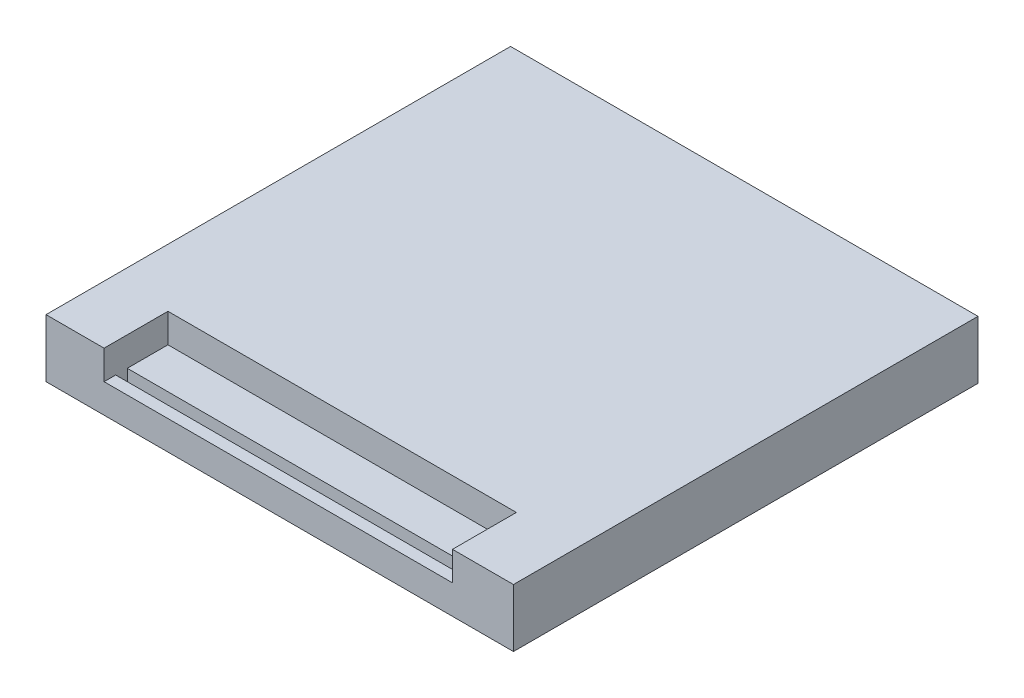
ISO-10303-21;
HEADER;
FILE_DESCRIPTION(('STEP AP214'),'2;1');
FILE_NAME('part.step','',(''),(''),'','','');
FILE_SCHEMA(('AUTOMOTIVE_DESIGN { 1 0 10303 214 1 1 1 1 }'));
ENDSEC;
DATA;
#1=APPLICATION_CONTEXT('core data for automotive mechanical design processes');
#2=APPLICATION_PROTOCOL_DEFINITION('international standard','automotive_design',2000,#1);
#3=PRODUCT_CONTEXT('',#1,'mechanical');
#4=PRODUCT('Part','Part','',(#3));
#5=PRODUCT_RELATED_PRODUCT_CATEGORY('part','',(#4));
#6=PRODUCT_DEFINITION_FORMATION('','',#4);
#7=PRODUCT_DEFINITION_CONTEXT('part definition',#1,'design');
#8=PRODUCT_DEFINITION('design','',#6,#7);
#9=PRODUCT_DEFINITION_SHAPE('','',#8);
#10=(LENGTH_UNIT() NAMED_UNIT(*) SI_UNIT(.MILLI.,.METRE.));
#11=(NAMED_UNIT(*) PLANE_ANGLE_UNIT() SI_UNIT($,.RADIAN.));
#12=(NAMED_UNIT(*) SI_UNIT($,.STERADIAN.) SOLID_ANGLE_UNIT());
#13=UNCERTAINTY_MEASURE_WITH_UNIT(LENGTH_MEASURE(1.E-05),#10,'distance_accuracy_value','');
#14=(GEOMETRIC_REPRESENTATION_CONTEXT(3) GLOBAL_UNCERTAINTY_ASSIGNED_CONTEXT((#13)) GLOBAL_UNIT_ASSIGNED_CONTEXT((#10,
#11,#12)) REPRESENTATION_CONTEXT('',''));
#15=CARTESIAN_POINT('',(0.,0.,0.));
#16=DIRECTION('',(0.,0.,1.));
#17=DIRECTION('',(1.,0.,0.));
#18=AXIS2_PLACEMENT_3D('',#15,#16,#17);
#19=CARTESIAN_POINT('',(111.833045973595,5.,39.9999999999999));
#20=DIRECTION('',(0.,-1.,0.));
#21=DIRECTION('',(0.,0.,-1.));
#22=AXIS2_PLACEMENT_3D('',#19,#20,#21);
#23=PLANE('',#22);
#24=DIRECTION('',(0.,0.,1.));
#25=VECTOR('',#24,1.);
#26=CARTESIAN_POINT('',(-30.2500000000001,5.,39.9999999999999));
#27=LINE('',#26,#25);
#28=CARTESIAN_POINT('',(-30.2500000000001,5.,28.9999999999999));
#29=VERTEX_POINT('',#28);
#30=CARTESIAN_POINT('',(-30.2500000000001,5.,35.9999999999999));
#31=VERTEX_POINT('',#30);
#32=EDGE_CURVE('E142',#29,#31,#27,.T.);
#33=ORIENTED_EDGE('',*,*,#32,.T.);
#34=DIRECTION('',(-1.,0.,0.));
#35=VECTOR('',#34,1.);
#36=CARTESIAN_POINT('',(102.578427124746,5.,35.9999999999999));
#37=LINE('',#36,#35);
#38=CARTESIAN_POINT('',(29.7499999999999,5.,35.9999999999999));
#39=VERTEX_POINT('',#38);
#40=EDGE_CURVE('E131',#39,#31,#37,.T.);
#41=ORIENTED_EDGE('',*,*,#40,.F.);
#42=DIRECTION('',(0.,0.,1.));
#43=VECTOR('',#42,1.);
#44=CARTESIAN_POINT('',(29.7499999999999,5.,39.9999999999999));
#45=LINE('',#44,#43);
#46=CARTESIAN_POINT('',(29.7499999999999,5.,28.9999999999999));
#47=VERTEX_POINT('',#46);
#48=EDGE_CURVE('E139',#47,#39,#45,.T.);
#49=ORIENTED_EDGE('',*,*,#48,.F.);
#50=DIRECTION('',(-1.,0.,0.));
#51=VECTOR('',#50,1.);
#52=CARTESIAN_POINT('',(111.833045973595,5.,28.9999999999999));
#53=LINE('',#52,#51);
#54=EDGE_CURVE('E153',#47,#29,#53,.T.);
#55=ORIENTED_EDGE('',*,*,#54,.T.);
#56=EDGE_LOOP('',(#33,#41,#49,#55));
#57=FACE_BOUND('',#56,.T.);
#58=ADVANCED_FACE('F36',(#57),#23,.F.);
#59=CARTESIAN_POINT('',(40.25,10.,-40.0000000000001));
#60=DIRECTION('',(-1.,0.,0.));
#61=DIRECTION('',(0.,0.,1.));
#62=AXIS2_PLACEMENT_3D('',#59,#60,#61);
#63=PLANE('',#62);
#64=DIRECTION('',(0.,0.,-1.));
#65=VECTOR('',#64,1.);
#66=CARTESIAN_POINT('',(40.25,0.,-40.0000000000001));
#67=LINE('',#66,#65);
#68=CARTESIAN_POINT('',(40.25,0.,39.9999999999999));
#69=VERTEX_POINT('',#68);
#70=CARTESIAN_POINT('',(40.25,0.,-40.0000000000001));
#71=VERTEX_POINT('',#70);
#72=EDGE_CURVE('E174',#69,#71,#67,.T.);
#73=ORIENTED_EDGE('',*,*,#72,.T.);
#74=DIRECTION('',(0.,-1.,0.));
#75=VECTOR('',#74,1.);
#76=CARTESIAN_POINT('',(40.25,10.,-40.0000000000001));
#77=LINE('',#76,#75);
#78=CARTESIAN_POINT('',(40.25,10.,-40.0000000000001));
#79=VERTEX_POINT('',#78);
#80=EDGE_CURVE('E13',#79,#71,#77,.T.);
#81=ORIENTED_EDGE('',*,*,#80,.F.);
#82=DIRECTION('',(0.,0.,-1.));
#83=VECTOR('',#82,1.);
#84=CARTESIAN_POINT('',(40.25,10.,-40.0000000000001));
#85=LINE('',#84,#83);
#86=CARTESIAN_POINT('',(40.25,10.,39.9999999999999));
#87=VERTEX_POINT('',#86);
#88=EDGE_CURVE('E161',#87,#79,#85,.T.);
#89=ORIENTED_EDGE('',*,*,#88,.F.);
#90=DIRECTION('',(0.,-1.,0.));
#91=VECTOR('',#90,1.);
#92=CARTESIAN_POINT('',(40.25,10.,39.9999999999999));
#93=LINE('',#92,#91);
#94=EDGE_CURVE('E173',#87,#69,#93,.T.);
#95=ORIENTED_EDGE('',*,*,#94,.T.);
#96=EDGE_LOOP('',(#73,#81,#89,#95));
#97=FACE_BOUND('',#96,.T.);
#98=ADVANCED_FACE('F38',(#97),#63,.F.);
#99=CARTESIAN_POINT('',(-40.2500000000001,10.,-40.0000000000001));
#100=DIRECTION('',(0.,0.,1.));
#101=DIRECTION('',(1.,0.,0.));
#102=AXIS2_PLACEMENT_3D('',#99,#100,#101);
#103=PLANE('',#102);
#104=DIRECTION('',(-1.,0.,0.));
#105=VECTOR('',#104,1.);
#106=CARTESIAN_POINT('',(-40.2500000000001,0.,-40.0000000000001));
#107=LINE('',#106,#105);
#108=CARTESIAN_POINT('',(-40.2500000000001,0.,-40.0000000000001));
#109=VERTEX_POINT('',#108);
#110=EDGE_CURVE('E177',#71,#109,#107,.T.);
#111=ORIENTED_EDGE('',*,*,#110,.T.);
#112=DIRECTION('',(0.,-1.,0.));
#113=VECTOR('',#112,1.);
#114=CARTESIAN_POINT('',(-40.2500000000001,10.,-40.0000000000001));
#115=LINE('',#114,#113);
#116=CARTESIAN_POINT('',(-40.2500000000001,10.,-40.0000000000001));
#117=VERTEX_POINT('',#116);
#118=EDGE_CURVE('E44',#117,#109,#115,.T.);
#119=ORIENTED_EDGE('',*,*,#118,.F.);
#120=DIRECTION('',(-1.,0.,0.));
#121=VECTOR('',#120,1.);
#122=CARTESIAN_POINT('',(-40.2500000000001,10.,-40.0000000000001));
#123=LINE('',#122,#121);
#124=EDGE_CURVE('E164',#79,#117,#123,.T.);
#125=ORIENTED_EDGE('',*,*,#124,.F.);
#126=ORIENTED_EDGE('',*,*,#80,.T.);
#127=EDGE_LOOP('',(#111,#119,#125,#126));
#128=FACE_BOUND('',#127,.T.);
#129=ADVANCED_FACE('F262',(#128),#103,.F.);
#130=CARTESIAN_POINT('',(-40.2500000000001,10.,-40.0000000000001));
#131=DIRECTION('',(1.,0.,0.));
#132=DIRECTION('',(0.,0.,-1.));
#133=AXIS2_PLACEMENT_3D('',#130,#131,#132);
#134=PLANE('',#133);
#135=DIRECTION('',(0.,0.,1.));
#136=VECTOR('',#135,1.);
#137=CARTESIAN_POINT('',(-40.2500000000001,0.,-40.0000000000001));
#138=LINE('',#137,#136);
#139=CARTESIAN_POINT('',(-40.2500000000001,0.,39.9999999999999));
#140=VERTEX_POINT('',#139);
#141=EDGE_CURVE('E179',#109,#140,#138,.T.);
#142=ORIENTED_EDGE('',*,*,#141,.T.);
#143=DIRECTION('',(0.,-1.,0.));
#144=VECTOR('',#143,1.);
#145=CARTESIAN_POINT('',(-40.2500000000001,10.,39.9999999999999));
#146=LINE('',#145,#144);
#147=CARTESIAN_POINT('',(-40.2500000000001,10.,39.9999999999999));
#148=VERTEX_POINT('',#147);
#149=EDGE_CURVE('E184',#148,#140,#146,.T.);
#150=ORIENTED_EDGE('',*,*,#149,.F.);
#151=DIRECTION('',(0.,0.,1.));
#152=VECTOR('',#151,1.);
#153=CARTESIAN_POINT('',(-40.2500000000001,10.,-40.0000000000001));
#154=LINE('',#153,#152);
#155=EDGE_CURVE('E167',#117,#148,#154,.T.);
#156=ORIENTED_EDGE('',*,*,#155,.F.);
#157=ORIENTED_EDGE('',*,*,#118,.T.);
#158=EDGE_LOOP('',(#142,#150,#156,#157));
#159=FACE_BOUND('',#158,.T.);
#160=ADVANCED_FACE('F191',(#159),#134,.F.);
#161=CARTESIAN_POINT('',(-40.2500000000001,10.,39.9999999999999));
#162=DIRECTION('',(0.,0.,-1.));
#163=DIRECTION('',(-1.,0.,0.));
#164=AXIS2_PLACEMENT_3D('',#161,#162,#163);
#165=PLANE('',#164);
#166=DIRECTION('',(1.,0.,0.));
#167=VECTOR('',#166,1.);
#168=CARTESIAN_POINT('',(-40.2500000000001,10.,39.9999999999999));
#169=LINE('',#168,#167);
#170=CARTESIAN_POINT('',(29.7499999999999,10.,39.9999999999999));
#171=VERTEX_POINT('',#170);
#172=EDGE_CURVE('E169',#171,#87,#169,.T.);
#173=ORIENTED_EDGE('',*,*,#172,.F.);
#174=DIRECTION('',(0.,1.,0.));
#175=VECTOR('',#174,1.);
#176=CARTESIAN_POINT('',(29.7499999999999,10.,39.9999999999999));
#177=LINE('',#176,#175);
#178=CARTESIAN_POINT('',(29.7499999999999,5.,39.9999999999999));
#179=VERTEX_POINT('',#178);
#180=EDGE_CURVE('E151',#179,#171,#177,.T.);
#181=ORIENTED_EDGE('',*,*,#180,.F.);
#182=DIRECTION('',(-1.,0.,0.));
#183=VECTOR('',#182,1.);
#184=CARTESIAN_POINT('',(111.833045973595,5.,39.9999999999999));
#185=LINE('',#184,#183);
#186=CARTESIAN_POINT('',(-30.2500000000001,5.,39.9999999999999));
#187=VERTEX_POINT('',#186);
#188=EDGE_CURVE('E147',#179,#187,#185,.T.);
#189=ORIENTED_EDGE('',*,*,#188,.T.);
#190=DIRECTION('',(0.,1.,0.));
#191=VECTOR('',#190,1.);
#192=CARTESIAN_POINT('',(-30.2500000000001,10.,39.9999999999999));
#193=LINE('',#192,#191);
#194=CARTESIAN_POINT('',(-30.2500000000001,10.,39.9999999999999));
#195=VERTEX_POINT('',#194);
#196=EDGE_CURVE('E223',#187,#195,#193,.T.);
#197=ORIENTED_EDGE('',*,*,#196,.T.);
#198=EDGE_CURVE('E170',#148,#195,#169,.T.);
#199=ORIENTED_EDGE('',*,*,#198,.F.);
#200=ORIENTED_EDGE('',*,*,#149,.T.);
#201=DIRECTION('',(1.,0.,0.));
#202=VECTOR('',#201,1.);
#203=CARTESIAN_POINT('',(-40.2500000000001,0.,39.9999999999999));
#204=LINE('',#203,#202);
#205=EDGE_CURVE('E165',#140,#69,#204,.T.);
#206=ORIENTED_EDGE('',*,*,#205,.T.);
#207=ORIENTED_EDGE('',*,*,#94,.F.);
#208=EDGE_LOOP('',(#173,#181,#189,#197,#199,#200,#206,#207));
#209=FACE_BOUND('',#208,.T.);
#210=ADVANCED_FACE('F201',(#209),#165,.F.);
#211=CARTESIAN_POINT('',(0.,10.,0.));
#212=DIRECTION('',(0.,1.,0.));
#213=DIRECTION('',(0.,0.,1.));
#214=AXIS2_PLACEMENT_3D('',#211,#212,#213);
#215=PLANE('',#214);
#216=DIRECTION('',(0.,0.,-1.));
#217=VECTOR('',#216,1.);
#218=CARTESIAN_POINT('',(29.7499999999999,10.,39.9999999999999));
#219=LINE('',#218,#217);
#220=CARTESIAN_POINT('',(29.7499999999999,10.,28.9999999999999));
#221=VERTEX_POINT('',#220);
#222=EDGE_CURVE('E59',#171,#221,#219,.T.);
#223=ORIENTED_EDGE('',*,*,#222,.F.);
#224=ORIENTED_EDGE('',*,*,#172,.T.);
#225=ORIENTED_EDGE('',*,*,#88,.T.);
#226=ORIENTED_EDGE('',*,*,#124,.T.);
#227=ORIENTED_EDGE('',*,*,#155,.T.);
#228=ORIENTED_EDGE('',*,*,#198,.T.);
#229=DIRECTION('',(0.,0.,-1.));
#230=VECTOR('',#229,1.);
#231=CARTESIAN_POINT('',(-30.2500000000001,10.,39.9999999999999));
#232=LINE('',#231,#230);
#233=CARTESIAN_POINT('',(-30.2500000000001,10.,28.9999999999999));
#234=VERTEX_POINT('',#233);
#235=EDGE_CURVE('E227',#195,#234,#232,.T.);
#236=ORIENTED_EDGE('',*,*,#235,.T.);
#237=DIRECTION('',(-1.,0.,0.));
#238=VECTOR('',#237,1.);
#239=CARTESIAN_POINT('',(111.833045973595,10.,28.9999999999999));
#240=LINE('',#239,#238);
#241=EDGE_CURVE('E157',#221,#234,#240,.T.);
#242=ORIENTED_EDGE('',*,*,#241,.F.);
#243=EDGE_LOOP('',(#223,#224,#225,#226,#227,#228,#236,#242));
#244=FACE_BOUND('',#243,.T.);
#245=ADVANCED_FACE('F207',(#244),#215,.T.);
#246=CARTESIAN_POINT('',(0.,0.,0.));
#247=DIRECTION('',(0.,1.,0.));
#248=DIRECTION('',(0.,0.,1.));
#249=AXIS2_PLACEMENT_3D('',#246,#247,#248);
#250=PLANE('',#249);
#251=ORIENTED_EDGE('',*,*,#72,.F.);
#252=ORIENTED_EDGE('',*,*,#205,.F.);
#253=ORIENTED_EDGE('',*,*,#141,.F.);
#254=ORIENTED_EDGE('',*,*,#110,.F.);
#255=EDGE_LOOP('',(#251,#252,#253,#254));
#256=FACE_BOUND('',#255,.T.);
#257=ADVANCED_FACE('F197',(#256),#250,.F.);
#258=CARTESIAN_POINT('',(29.7499999999999,10.,-40.0000000000001));
#259=DIRECTION('',(1.,0.,0.));
#260=DIRECTION('',(0.,0.,-1.));
#261=AXIS2_PLACEMENT_3D('',#258,#259,#260);
#262=PLANE('',#261);
#263=ORIENTED_EDGE('',*,*,#180,.T.);
#264=ORIENTED_EDGE('',*,*,#222,.T.);
#265=DIRECTION('',(0.,-1.,0.));
#266=VECTOR('',#265,1.);
#267=CARTESIAN_POINT('',(29.7499999999999,10.,28.9999999999999));
#268=LINE('',#267,#266);
#269=EDGE_CURVE('E146',#221,#47,#268,.T.);
#270=ORIENTED_EDGE('',*,*,#269,.T.);
#271=ORIENTED_EDGE('',*,*,#48,.T.);
#272=DIRECTION('',(0.,-1.,0.));
#273=VECTOR('',#272,1.);
#274=CARTESIAN_POINT('',(29.7499999999999,5.,35.9999999999999));
#275=LINE('',#274,#273);
#276=CARTESIAN_POINT('',(29.7499999999999,3.,35.9999999999999));
#277=VERTEX_POINT('',#276);
#278=EDGE_CURVE('E127',#39,#277,#275,.T.);
#279=ORIENTED_EDGE('',*,*,#278,.T.);
#280=DIRECTION('',(0.,0.,1.));
#281=VECTOR('',#280,1.);
#282=CARTESIAN_POINT('',(29.7499999999999,3.,37.9999999999999));
#283=LINE('',#282,#281);
#284=CARTESIAN_POINT('',(29.7499999999999,3.,37.9999999999999));
#285=VERTEX_POINT('',#284);
#286=EDGE_CURVE('E244',#277,#285,#283,.T.);
#287=ORIENTED_EDGE('',*,*,#286,.T.);
#288=DIRECTION('',(0.,1.,0.));
#289=VECTOR('',#288,1.);
#290=CARTESIAN_POINT('',(29.7499999999999,5.,37.9999999999999));
#291=LINE('',#290,#289);
#292=CARTESIAN_POINT('',(29.7499999999999,5.,37.9999999999999));
#293=VERTEX_POINT('',#292);
#294=EDGE_CURVE('E213',#285,#293,#291,.T.);
#295=ORIENTED_EDGE('',*,*,#294,.T.);
#296=EDGE_CURVE('E148',#293,#179,#45,.T.);
#297=ORIENTED_EDGE('',*,*,#296,.T.);
#298=EDGE_LOOP('',(#263,#264,#270,#271,#279,#287,#295,#297));
#299=FACE_BOUND('',#298,.T.);
#300=ADVANCED_FACE('F145',(#299),#262,.F.);
#301=CARTESIAN_POINT('',(-30.2500000000001,0.,0.));
#302=DIRECTION('',(1.,0.,0.));
#303=DIRECTION('',(0.,0.,-1.));
#304=AXIS2_PLACEMENT_3D('',#301,#302,#303);
#305=PLANE('',#304);
#306=ORIENTED_EDGE('',*,*,#196,.F.);
#307=CARTESIAN_POINT('',(-30.2500000000001,5.,37.9999999999999));
#308=VERTEX_POINT('',#307);
#309=EDGE_CURVE('E217',#308,#187,#27,.T.);
#310=ORIENTED_EDGE('',*,*,#309,.F.);
#311=DIRECTION('',(0.,1.,0.));
#312=VECTOR('',#311,1.);
#313=CARTESIAN_POINT('',(-30.2500000000001,5.,37.9999999999999));
#314=LINE('',#313,#312);
#315=CARTESIAN_POINT('',(-30.2500000000001,3.,37.9999999999999));
#316=VERTEX_POINT('',#315);
#317=EDGE_CURVE('E51',#316,#308,#314,.T.);
#318=ORIENTED_EDGE('',*,*,#317,.F.);
#319=DIRECTION('',(0.,0.,1.));
#320=VECTOR('',#319,1.);
#321=CARTESIAN_POINT('',(-30.2500000000001,3.,37.9999999999999));
#322=LINE('',#321,#320);
#323=CARTESIAN_POINT('',(-30.2500000000001,3.,35.9999999999999));
#324=VERTEX_POINT('',#323);
#325=EDGE_CURVE('E143',#324,#316,#322,.T.);
#326=ORIENTED_EDGE('',*,*,#325,.F.);
#327=DIRECTION('',(0.,-1.,0.));
#328=VECTOR('',#327,1.);
#329=CARTESIAN_POINT('',(-30.2500000000001,5.,35.9999999999999));
#330=LINE('',#329,#328);
#331=EDGE_CURVE('E236',#31,#324,#330,.T.);
#332=ORIENTED_EDGE('',*,*,#331,.F.);
#333=ORIENTED_EDGE('',*,*,#32,.F.);
#334=DIRECTION('',(0.,-1.,0.));
#335=VECTOR('',#334,1.);
#336=CARTESIAN_POINT('',(-30.2500000000001,10.,28.9999999999999));
#337=LINE('',#336,#335);
#338=EDGE_CURVE('E221',#234,#29,#337,.T.);
#339=ORIENTED_EDGE('',*,*,#338,.F.);
#340=ORIENTED_EDGE('',*,*,#235,.F.);
#341=EDGE_LOOP('',(#306,#310,#318,#326,#332,#333,#339,#340));
#342=FACE_BOUND('',#341,.T.);
#343=ADVANCED_FACE('F224',(#342),#305,.T.);
#344=CARTESIAN_POINT('',(111.833045973595,10.,28.9999999999999));
#345=DIRECTION('',(0.,0.,-1.));
#346=DIRECTION('',(-1.,0.,0.));
#347=AXIS2_PLACEMENT_3D('',#344,#345,#346);
#348=PLANE('',#347);
#349=ORIENTED_EDGE('',*,*,#241,.T.);
#350=ORIENTED_EDGE('',*,*,#338,.T.);
#351=ORIENTED_EDGE('',*,*,#54,.F.);
#352=ORIENTED_EDGE('',*,*,#269,.F.);
#353=EDGE_LOOP('',(#349,#350,#351,#352));
#354=FACE_BOUND('',#353,.T.);
#355=ADVANCED_FACE('F234',(#354),#348,.F.);
#356=ORIENTED_EDGE('',*,*,#296,.F.);
#357=DIRECTION('',(-1.,0.,0.));
#358=VECTOR('',#357,1.);
#359=CARTESIAN_POINT('',(102.578427124746,5.,37.9999999999999));
#360=LINE('',#359,#358);
#361=EDGE_CURVE('E219',#293,#308,#360,.T.);
#362=ORIENTED_EDGE('',*,*,#361,.T.);
#363=ORIENTED_EDGE('',*,*,#309,.T.);
#364=ORIENTED_EDGE('',*,*,#188,.F.);
#365=EDGE_LOOP('',(#356,#362,#363,#364));
#366=FACE_BOUND('',#365,.T.);
#367=ADVANCED_FACE('F215',(#366),#23,.F.);
#368=CARTESIAN_POINT('',(102.578427124746,5.,35.9999999999999));
#369=DIRECTION('',(0.,0.,-1.));
#370=DIRECTION('',(-1.,0.,0.));
#371=AXIS2_PLACEMENT_3D('',#368,#369,#370);
#372=PLANE('',#371);
#373=ORIENTED_EDGE('',*,*,#40,.T.);
#374=ORIENTED_EDGE('',*,*,#331,.T.);
#375=DIRECTION('',(-1.,0.,0.));
#376=VECTOR('',#375,1.);
#377=CARTESIAN_POINT('',(102.578427124746,3.,35.9999999999999));
#378=LINE('',#377,#376);
#379=EDGE_CURVE('E133',#277,#324,#378,.T.);
#380=ORIENTED_EDGE('',*,*,#379,.F.);
#381=ORIENTED_EDGE('',*,*,#278,.F.);
#382=EDGE_LOOP('',(#373,#374,#380,#381));
#383=FACE_BOUND('',#382,.T.);
#384=ADVANCED_FACE('F129',(#383),#372,.F.);
#385=CARTESIAN_POINT('',(102.578427124746,3.,37.9999999999999));
#386=DIRECTION('',(0.,-1.,0.));
#387=DIRECTION('',(0.,0.,-1.));
#388=AXIS2_PLACEMENT_3D('',#385,#386,#387);
#389=PLANE('',#388);
#390=ORIENTED_EDGE('',*,*,#379,.T.);
#391=ORIENTED_EDGE('',*,*,#325,.T.);
#392=DIRECTION('',(-1.,0.,0.));
#393=VECTOR('',#392,1.);
#394=CARTESIAN_POINT('',(102.578427124746,3.,37.9999999999999));
#395=LINE('',#394,#393);
#396=EDGE_CURVE('E243',#285,#316,#395,.T.);
#397=ORIENTED_EDGE('',*,*,#396,.F.);
#398=ORIENTED_EDGE('',*,*,#286,.F.);
#399=EDGE_LOOP('',(#390,#391,#397,#398));
#400=FACE_BOUND('',#399,.T.);
#401=ADVANCED_FACE('F248',(#400),#389,.F.);
#402=CARTESIAN_POINT('',(102.578427124746,5.,37.9999999999999));
#403=DIRECTION('',(0.,0.,1.));
#404=DIRECTION('',(1.,0.,0.));
#405=AXIS2_PLACEMENT_3D('',#402,#403,#404);
#406=PLANE('',#405);
#407=ORIENTED_EDGE('',*,*,#396,.T.);
#408=ORIENTED_EDGE('',*,*,#317,.T.);
#409=ORIENTED_EDGE('',*,*,#361,.F.);
#410=ORIENTED_EDGE('',*,*,#294,.F.);
#411=EDGE_LOOP('',(#407,#408,#409,#410));
#412=FACE_BOUND('',#411,.T.);
#413=ADVANCED_FACE('F250',(#412),#406,.F.);
#414=CLOSED_SHELL('',(#58,#98,#129,#160,#210,#245,#257,#300,#343,#355,#367,#384,#401,#413));
#415=MANIFOLD_SOLID_BREP('B2',#414);
#416=ADVANCED_BREP_SHAPE_REPRESENTATION('',(#18,#415),#14);
#417=SHAPE_DEFINITION_REPRESENTATION(#9,#416);
ENDSEC;
END-ISO-10303-21;
